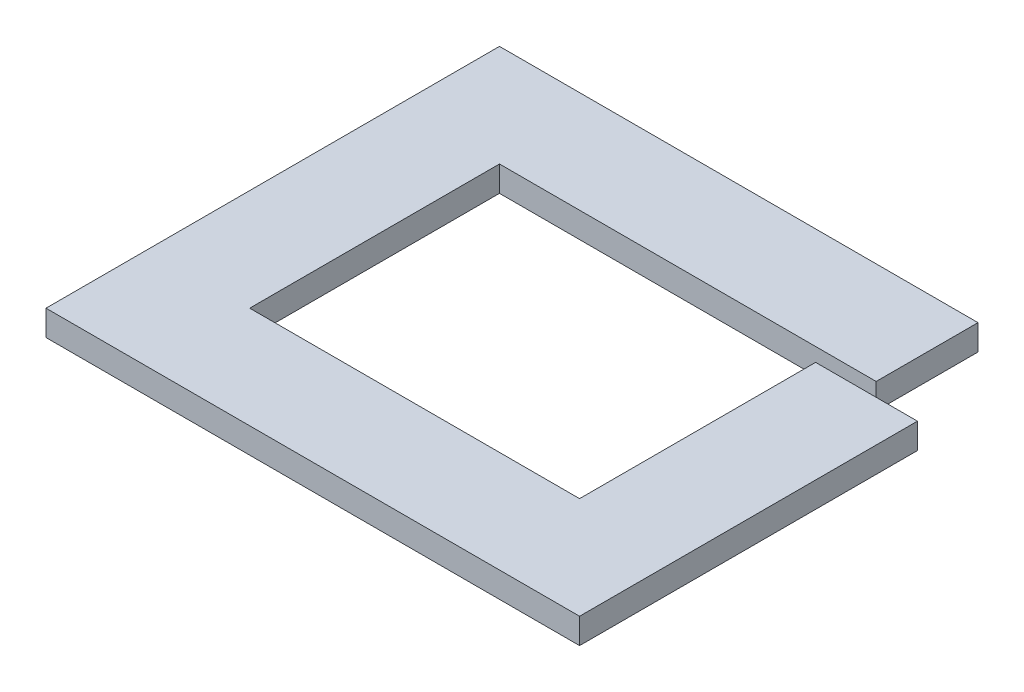
ISO-10303-21;
HEADER;
FILE_DESCRIPTION(('STEP AP214'),'2;1');
FILE_NAME('part.step','',(''),(''),'','','');
FILE_SCHEMA(('AUTOMOTIVE_DESIGN { 1 0 10303 214 1 1 1 1 }'));
ENDSEC;
DATA;
#1=APPLICATION_CONTEXT('core data for automotive mechanical design processes');
#2=APPLICATION_PROTOCOL_DEFINITION('international standard','automotive_design',2000,#1);
#3=PRODUCT_CONTEXT('',#1,'mechanical');
#4=PRODUCT('Part','Part','',(#3));
#5=PRODUCT_RELATED_PRODUCT_CATEGORY('part','',(#4));
#6=PRODUCT_DEFINITION_FORMATION('','',#4);
#7=PRODUCT_DEFINITION_CONTEXT('part definition',#1,'design');
#8=PRODUCT_DEFINITION('design','',#6,#7);
#9=PRODUCT_DEFINITION_SHAPE('','',#8);
#10=(LENGTH_UNIT() NAMED_UNIT(*) SI_UNIT(.MILLI.,.METRE.));
#11=(NAMED_UNIT(*) PLANE_ANGLE_UNIT() SI_UNIT($,.RADIAN.));
#12=(NAMED_UNIT(*) SI_UNIT($,.STERADIAN.) SOLID_ANGLE_UNIT());
#13=UNCERTAINTY_MEASURE_WITH_UNIT(LENGTH_MEASURE(1.E-05),#10,'distance_accuracy_value','');
#14=(GEOMETRIC_REPRESENTATION_CONTEXT(3) GLOBAL_UNCERTAINTY_ASSIGNED_CONTEXT((#13)) GLOBAL_UNIT_ASSIGNED_CONTEXT((#10,
#11,#12)) REPRESENTATION_CONTEXT('',''));
#15=CARTESIAN_POINT('',(0.,0.,0.));
#16=DIRECTION('',(0.,0.,1.));
#17=DIRECTION('',(1.,0.,0.));
#18=AXIS2_PLACEMENT_3D('',#15,#16,#17);
#19=CARTESIAN_POINT('',(-22817.9108837107,5864.45712854682,0.));
#20=DIRECTION('',(1.,0.,0.));
#21=DIRECTION('',(0.,0.,-1.));
#22=AXIS2_PLACEMENT_3D('',#19,#20,#21);
#23=PLANE('',#22);
#24=DIRECTION('',(0.,0.,1.));
#25=VECTOR('',#24,1.);
#26=CARTESIAN_POINT('',(-22817.9108837107,5844.45712854682,0.));
#27=LINE('',#26,#25);
#28=CARTESIAN_POINT('',(-22817.9108837107,5844.45712854682,39924.6673627138));
#29=VERTEX_POINT('',#28);
#30=CARTESIAN_POINT('',(-22817.9108837107,5844.45712854682,40004.6673627138));
#31=VERTEX_POINT('',#30);
#32=EDGE_CURVE('E193',#29,#31,#27,.T.);
#33=ORIENTED_EDGE('',*,*,#32,.F.);
#34=DIRECTION('',(0.,-1.,0.));
#35=VECTOR('',#34,1.);
#36=CARTESIAN_POINT('',(-22817.9108837107,5864.45712854682,39924.6673627138));
#37=LINE('',#36,#35);
#38=CARTESIAN_POINT('',(-22817.9108837107,5864.45712854682,39924.6673627138));
#39=VERTEX_POINT('',#38);
#40=EDGE_CURVE('E222',#39,#29,#37,.T.);
#41=ORIENTED_EDGE('',*,*,#40,.F.);
#42=DIRECTION('',(0.,0.,1.));
#43=VECTOR('',#42,1.);
#44=CARTESIAN_POINT('',(-22817.9108837107,5864.45712854682,0.));
#45=LINE('',#44,#43);
#46=CARTESIAN_POINT('',(-22817.9108837107,5864.45712854682,40004.6673627138));
#47=VERTEX_POINT('',#46);
#48=EDGE_CURVE('E229',#39,#47,#45,.T.);
#49=ORIENTED_EDGE('',*,*,#48,.T.);
#50=DIRECTION('',(0.,-1.,0.));
#51=VECTOR('',#50,1.);
#52=CARTESIAN_POINT('',(-22817.9108837107,5864.45712854682,40004.6673627138));
#53=LINE('',#52,#51);
#54=EDGE_CURVE('E90',#47,#31,#53,.T.);
#55=ORIENTED_EDGE('',*,*,#54,.T.);
#56=EDGE_LOOP('',(#33,#41,#49,#55));
#57=FACE_BOUND('',#56,.T.);
#58=ADVANCED_FACE('F81',(#57),#23,.T.);
#59=CARTESIAN_POINT('',(0.,5844.45712854682,0.));
#60=DIRECTION('',(0.,1.,0.));
#61=DIRECTION('',(0.,0.,1.));
#62=AXIS2_PLACEMENT_3D('',#59,#60,#61);
#63=PLANE('',#62);
#64=DIRECTION('',(1.,0.,0.));
#65=VECTOR('',#64,1.);
#66=CARTESIAN_POINT('',(0.,5844.45712854682,40004.6673627138));
#67=LINE('',#66,#65);
#68=CARTESIAN_POINT('',(-23113.7900934544,5844.45712854682,40004.6673627138));
#69=VERTEX_POINT('',#68);
#70=EDGE_CURVE('E190',#69,#31,#67,.T.);
#71=ORIENTED_EDGE('',*,*,#70,.F.);
#72=DIRECTION('',(0.,0.,1.));
#73=VECTOR('',#72,1.);
#74=CARTESIAN_POINT('',(-23113.7900934544,5844.45712854682,0.));
#75=LINE('',#74,#73);
#76=CARTESIAN_POINT('',(-23113.7900934544,5844.45712854682,40200.8713129914));
#77=VERTEX_POINT('',#76);
#78=EDGE_CURVE('E188',#69,#77,#75,.T.);
#79=ORIENTED_EDGE('',*,*,#78,.T.);
#80=DIRECTION('',(1.,0.,0.));
#81=VECTOR('',#80,1.);
#82=CARTESIAN_POINT('',(0.,5844.45712854682,40200.8713129914));
#83=LINE('',#82,#81);
#84=CARTESIAN_POINT('',(-22854.6699780642,5844.45712854682,40200.8713129914));
#85=VERTEX_POINT('',#84);
#86=EDGE_CURVE('E207',#77,#85,#83,.T.);
#87=ORIENTED_EDGE('',*,*,#86,.T.);
#88=DIRECTION('',(0.,0.,-1.));
#89=VECTOR('',#88,1.);
#90=CARTESIAN_POINT('',(-22854.6699780642,5844.45712854682,0.));
#91=LINE('',#90,#89);
#92=CARTESIAN_POINT('',(-22854.6699780642,5844.45712854682,40015.4673627138));
#93=VERTEX_POINT('',#92);
#94=EDGE_CURVE('E205',#85,#93,#91,.T.);
#95=ORIENTED_EDGE('',*,*,#94,.T.);
#96=DIRECTION('',(-1.,0.,0.));
#97=VECTOR('',#96,1.);
#98=CARTESIAN_POINT('',(-1.50325820692424E-11,5844.45712854682,40015.4673627138));
#99=LINE('',#98,#97);
#100=CARTESIAN_POINT('',(-22774.6699780642,5844.45712854682,40015.4673627138));
#101=VERTEX_POINT('',#100);
#102=EDGE_CURVE('E177',#101,#93,#99,.T.);
#103=ORIENTED_EDGE('',*,*,#102,.F.);
#104=DIRECTION('',(0.,0.,-1.));
#105=VECTOR('',#104,1.);
#106=CARTESIAN_POINT('',(-22774.6699780642,5844.45712854682,0.));
#107=LINE('',#106,#105);
#108=CARTESIAN_POINT('',(-22774.6699780642,5844.45712854682,40280.8713129914));
#109=VERTEX_POINT('',#108);
#110=EDGE_CURVE('E202',#109,#101,#107,.T.);
#111=ORIENTED_EDGE('',*,*,#110,.F.);
#112=DIRECTION('',(1.,0.,0.));
#113=VECTOR('',#112,1.);
#114=CARTESIAN_POINT('',(0.,5844.45712854682,40280.8713129914));
#115=LINE('',#114,#113);
#116=CARTESIAN_POINT('',(-23193.7900934544,5844.45712854682,40280.8713129914));
#117=VERTEX_POINT('',#116);
#118=EDGE_CURVE('E200',#117,#109,#115,.T.);
#119=ORIENTED_EDGE('',*,*,#118,.F.);
#120=DIRECTION('',(0.,0.,1.));
#121=VECTOR('',#120,1.);
#122=CARTESIAN_POINT('',(-23193.7900934544,5844.45712854682,0.));
#123=LINE('',#122,#121);
#124=CARTESIAN_POINT('',(-23193.7900934544,5844.45712854682,39924.6673627138));
#125=VERTEX_POINT('',#124);
#126=EDGE_CURVE('E198',#125,#117,#123,.T.);
#127=ORIENTED_EDGE('',*,*,#126,.F.);
#128=DIRECTION('',(1.,0.,0.));
#129=VECTOR('',#128,1.);
#130=CARTESIAN_POINT('',(0.,5844.45712854682,39924.6673627138));
#131=LINE('',#130,#129);
#132=EDGE_CURVE('E196',#125,#29,#131,.T.);
#133=ORIENTED_EDGE('',*,*,#132,.T.);
#134=ORIENTED_EDGE('',*,*,#32,.T.);
#135=EDGE_LOOP('',(#71,#79,#87,#95,#103,#111,#119,#127,#133,#134));
#136=FACE_BOUND('',#135,.T.);
#137=ADVANCED_FACE('F234',(#136),#63,.F.);
#138=CARTESIAN_POINT('',(0.,5864.45712854682,40004.6673627138));
#139=DIRECTION('',(0.,0.,-1.));
#140=DIRECTION('',(-1.,0.,0.));
#141=AXIS2_PLACEMENT_3D('',#138,#139,#140);
#142=PLANE('',#141);
#143=ORIENTED_EDGE('',*,*,#70,.T.);
#144=ORIENTED_EDGE('',*,*,#54,.F.);
#145=DIRECTION('',(1.,0.,0.));
#146=VECTOR('',#145,1.);
#147=CARTESIAN_POINT('',(0.,5864.45712854682,40004.6673627138));
#148=LINE('',#147,#146);
#149=CARTESIAN_POINT('',(-23113.7900934544,5864.45712854682,40004.6673627138));
#150=VERTEX_POINT('',#149);
#151=EDGE_CURVE('E243',#150,#47,#148,.T.);
#152=ORIENTED_EDGE('',*,*,#151,.F.);
#153=DIRECTION('',(0.,-1.,0.));
#154=VECTOR('',#153,1.);
#155=CARTESIAN_POINT('',(-23113.7900934544,5864.45712854682,40004.6673627138));
#156=LINE('',#155,#154);
#157=EDGE_CURVE('E12',#150,#69,#156,.T.);
#158=ORIENTED_EDGE('',*,*,#157,.T.);
#159=EDGE_LOOP('',(#143,#144,#152,#158));
#160=FACE_BOUND('',#159,.T.);
#161=ADVANCED_FACE('F232',(#160),#142,.F.);
#162=CARTESIAN_POINT('',(0.,5864.45712854682,39924.6673627138));
#163=DIRECTION('',(0.,0.,-1.));
#164=DIRECTION('',(-1.,0.,0.));
#165=AXIS2_PLACEMENT_3D('',#162,#163,#164);
#166=PLANE('',#165);
#167=ORIENTED_EDGE('',*,*,#40,.T.);
#168=ORIENTED_EDGE('',*,*,#132,.F.);
#169=DIRECTION('',(0.,-1.,0.));
#170=VECTOR('',#169,1.);
#171=CARTESIAN_POINT('',(-23193.7900934544,5864.45712854682,39924.6673627138));
#172=LINE('',#171,#170);
#173=CARTESIAN_POINT('',(-23193.7900934544,5864.45712854682,39924.6673627138));
#174=VERTEX_POINT('',#173);
#175=EDGE_CURVE('E220',#174,#125,#172,.T.);
#176=ORIENTED_EDGE('',*,*,#175,.F.);
#177=DIRECTION('',(1.,0.,0.));
#178=VECTOR('',#177,1.);
#179=CARTESIAN_POINT('',(0.,5864.45712854682,39924.6673627138));
#180=LINE('',#179,#178);
#181=EDGE_CURVE('E241',#174,#39,#180,.T.);
#182=ORIENTED_EDGE('',*,*,#181,.T.);
#183=EDGE_LOOP('',(#167,#168,#176,#182));
#184=FACE_BOUND('',#183,.T.);
#185=ADVANCED_FACE('F239',(#184),#166,.T.);
#186=CARTESIAN_POINT('',(0.,5864.45712854682,0.));
#187=DIRECTION('',(0.,1.,0.));
#188=DIRECTION('',(0.,0.,1.));
#189=AXIS2_PLACEMENT_3D('',#186,#187,#188);
#190=PLANE('',#189);
#191=ORIENTED_EDGE('',*,*,#48,.F.);
#192=ORIENTED_EDGE('',*,*,#181,.F.);
#193=DIRECTION('',(0.,0.,1.));
#194=VECTOR('',#193,1.);
#195=CARTESIAN_POINT('',(-23193.7900934544,5864.45712854682,0.));
#196=LINE('',#195,#194);
#197=CARTESIAN_POINT('',(-23193.7900934544,5864.45712854682,40280.8713129914));
#198=VERTEX_POINT('',#197);
#199=EDGE_CURVE('E245',#174,#198,#196,.T.);
#200=ORIENTED_EDGE('',*,*,#199,.T.);
#201=DIRECTION('',(1.,0.,0.));
#202=VECTOR('',#201,1.);
#203=CARTESIAN_POINT('',(0.,5864.45712854682,40280.8713129914));
#204=LINE('',#203,#202);
#205=CARTESIAN_POINT('',(-22774.6699780642,5864.45712854682,40280.8713129914));
#206=VERTEX_POINT('',#205);
#207=EDGE_CURVE('E251',#198,#206,#204,.T.);
#208=ORIENTED_EDGE('',*,*,#207,.T.);
#209=DIRECTION('',(0.,0.,-1.));
#210=VECTOR('',#209,1.);
#211=CARTESIAN_POINT('',(-22774.6699780642,5864.45712854682,0.));
#212=LINE('',#211,#210);
#213=CARTESIAN_POINT('',(-22774.6699780642,5864.45712854682,40015.4673627138));
#214=VERTEX_POINT('',#213);
#215=EDGE_CURVE('E168',#206,#214,#212,.T.);
#216=ORIENTED_EDGE('',*,*,#215,.T.);
#217=DIRECTION('',(-1.,0.,0.));
#218=VECTOR('',#217,1.);
#219=CARTESIAN_POINT('',(-1.50325820692424E-11,5864.45712854682,40015.4673627138));
#220=LINE('',#219,#218);
#221=CARTESIAN_POINT('',(-22854.6699780642,5864.45712854682,40015.4673627138));
#222=VERTEX_POINT('',#221);
#223=EDGE_CURVE('E160',#214,#222,#220,.T.);
#224=ORIENTED_EDGE('',*,*,#223,.T.);
#225=DIRECTION('',(0.,0.,-1.));
#226=VECTOR('',#225,1.);
#227=CARTESIAN_POINT('',(-22854.6699780642,5864.45712854682,0.));
#228=LINE('',#227,#226);
#229=CARTESIAN_POINT('',(-22854.6699780642,5864.45712854682,40200.8713129914));
#230=VERTEX_POINT('',#229);
#231=EDGE_CURVE('E166',#230,#222,#228,.T.);
#232=ORIENTED_EDGE('',*,*,#231,.F.);
#233=DIRECTION('',(1.,0.,0.));
#234=VECTOR('',#233,1.);
#235=CARTESIAN_POINT('',(0.,5864.45712854682,40200.8713129914));
#236=LINE('',#235,#234);
#237=CARTESIAN_POINT('',(-23113.7900934544,5864.45712854682,40200.8713129914));
#238=VERTEX_POINT('',#237);
#239=EDGE_CURVE('E183',#238,#230,#236,.T.);
#240=ORIENTED_EDGE('',*,*,#239,.F.);
#241=DIRECTION('',(0.,0.,1.));
#242=VECTOR('',#241,1.);
#243=CARTESIAN_POINT('',(-23113.7900934544,5864.45712854682,0.));
#244=LINE('',#243,#242);
#245=EDGE_CURVE('E210',#150,#238,#244,.T.);
#246=ORIENTED_EDGE('',*,*,#245,.F.);
#247=ORIENTED_EDGE('',*,*,#151,.T.);
#248=EDGE_LOOP('',(#191,#192,#200,#208,#216,#224,#232,#240,#246,#247));
#249=FACE_BOUND('',#248,.T.);
#250=ADVANCED_FACE('F163',(#249),#190,.T.);
#251=CARTESIAN_POINT('',(-23193.7900934544,5864.45712854682,0.));
#252=DIRECTION('',(1.,0.,0.));
#253=DIRECTION('',(0.,0.,-1.));
#254=AXIS2_PLACEMENT_3D('',#251,#252,#253);
#255=PLANE('',#254);
#256=ORIENTED_EDGE('',*,*,#126,.T.);
#257=DIRECTION('',(0.,-1.,0.));
#258=VECTOR('',#257,1.);
#259=CARTESIAN_POINT('',(-23193.7900934544,5864.45712854682,40280.8713129914));
#260=LINE('',#259,#258);
#261=EDGE_CURVE('E217',#198,#117,#260,.T.);
#262=ORIENTED_EDGE('',*,*,#261,.F.);
#263=ORIENTED_EDGE('',*,*,#199,.F.);
#264=ORIENTED_EDGE('',*,*,#175,.T.);
#265=EDGE_LOOP('',(#256,#262,#263,#264));
#266=FACE_BOUND('',#265,.T.);
#267=ADVANCED_FACE('F275',(#266),#255,.F.);
#268=CARTESIAN_POINT('',(0.,5864.45712854682,40280.8713129914));
#269=DIRECTION('',(0.,0.,-1.));
#270=DIRECTION('',(-1.,0.,0.));
#271=AXIS2_PLACEMENT_3D('',#268,#269,#270);
#272=PLANE('',#271);
#273=ORIENTED_EDGE('',*,*,#118,.T.);
#274=DIRECTION('',(0.,-1.,0.));
#275=VECTOR('',#274,1.);
#276=CARTESIAN_POINT('',(-22774.6699780642,5864.45712854682,40280.8713129914));
#277=LINE('',#276,#275);
#278=EDGE_CURVE('E214',#206,#109,#277,.T.);
#279=ORIENTED_EDGE('',*,*,#278,.F.);
#280=ORIENTED_EDGE('',*,*,#207,.F.);
#281=ORIENTED_EDGE('',*,*,#261,.T.);
#282=EDGE_LOOP('',(#273,#279,#280,#281));
#283=FACE_BOUND('',#282,.T.);
#284=ADVANCED_FACE('F257',(#283),#272,.F.);
#285=CARTESIAN_POINT('',(-22774.6699780642,5864.45712854682,0.));
#286=DIRECTION('',(-1.,0.,0.));
#287=DIRECTION('',(0.,0.,1.));
#288=AXIS2_PLACEMENT_3D('',#285,#286,#287);
#289=PLANE('',#288);
#290=ORIENTED_EDGE('',*,*,#110,.T.);
#291=DIRECTION('',(0.,-1.,0.));
#292=VECTOR('',#291,1.);
#293=CARTESIAN_POINT('',(-22774.6699780642,5864.45712854682,40015.4673627138));
#294=LINE('',#293,#292);
#295=EDGE_CURVE('E180',#214,#101,#294,.T.);
#296=ORIENTED_EDGE('',*,*,#295,.F.);
#297=ORIENTED_EDGE('',*,*,#215,.F.);
#298=ORIENTED_EDGE('',*,*,#278,.T.);
#299=EDGE_LOOP('',(#290,#296,#297,#298));
#300=FACE_BOUND('',#299,.T.);
#301=ADVANCED_FACE('F260',(#300),#289,.F.);
#302=CARTESIAN_POINT('',(-1.50325820692424E-11,5864.45712854682,40015.4673627138));
#303=DIRECTION('',(0.,0.,1.));
#304=DIRECTION('',(1.,0.,0.));
#305=AXIS2_PLACEMENT_3D('',#302,#303,#304);
#306=PLANE('',#305);
#307=ORIENTED_EDGE('',*,*,#102,.T.);
#308=DIRECTION('',(0.,-1.,0.));
#309=VECTOR('',#308,1.);
#310=CARTESIAN_POINT('',(-22854.6699780642,5864.45712854682,40015.4673627138));
#311=LINE('',#310,#309);
#312=EDGE_CURVE('E174',#222,#93,#311,.T.);
#313=ORIENTED_EDGE('',*,*,#312,.F.);
#314=ORIENTED_EDGE('',*,*,#223,.F.);
#315=ORIENTED_EDGE('',*,*,#295,.T.);
#316=EDGE_LOOP('',(#307,#313,#314,#315));
#317=FACE_BOUND('',#316,.T.);
#318=ADVANCED_FACE('F175',(#317),#306,.F.);
#319=CARTESIAN_POINT('',(-22854.6699780642,5864.45712854682,0.));
#320=DIRECTION('',(-1.,0.,0.));
#321=DIRECTION('',(0.,0.,1.));
#322=AXIS2_PLACEMENT_3D('',#319,#320,#321);
#323=PLANE('',#322);
#324=ORIENTED_EDGE('',*,*,#94,.F.);
#325=DIRECTION('',(0.,-1.,0.));
#326=VECTOR('',#325,1.);
#327=CARTESIAN_POINT('',(-22854.6699780642,5864.45712854682,40200.8713129914));
#328=LINE('',#327,#326);
#329=EDGE_CURVE('E129',#230,#85,#328,.T.);
#330=ORIENTED_EDGE('',*,*,#329,.F.);
#331=ORIENTED_EDGE('',*,*,#231,.T.);
#332=ORIENTED_EDGE('',*,*,#312,.T.);
#333=EDGE_LOOP('',(#324,#330,#331,#332));
#334=FACE_BOUND('',#333,.T.);
#335=ADVANCED_FACE('F182',(#334),#323,.T.);
#336=CARTESIAN_POINT('',(0.,5864.45712854682,40200.8713129914));
#337=DIRECTION('',(0.,0.,-1.));
#338=DIRECTION('',(-1.,0.,0.));
#339=AXIS2_PLACEMENT_3D('',#336,#337,#338);
#340=PLANE('',#339);
#341=ORIENTED_EDGE('',*,*,#86,.F.);
#342=DIRECTION('',(0.,-1.,0.));
#343=VECTOR('',#342,1.);
#344=CARTESIAN_POINT('',(-23113.7900934544,5864.45712854682,40200.8713129914));
#345=LINE('',#344,#343);
#346=EDGE_CURVE('E98',#238,#77,#345,.T.);
#347=ORIENTED_EDGE('',*,*,#346,.F.);
#348=ORIENTED_EDGE('',*,*,#239,.T.);
#349=ORIENTED_EDGE('',*,*,#329,.T.);
#350=EDGE_LOOP('',(#341,#347,#348,#349));
#351=FACE_BOUND('',#350,.T.);
#352=ADVANCED_FACE('F261',(#351),#340,.T.);
#353=CARTESIAN_POINT('',(-23113.7900934544,5864.45712854682,0.));
#354=DIRECTION('',(1.,0.,0.));
#355=DIRECTION('',(0.,0.,-1.));
#356=AXIS2_PLACEMENT_3D('',#353,#354,#355);
#357=PLANE('',#356);
#358=ORIENTED_EDGE('',*,*,#78,.F.);
#359=ORIENTED_EDGE('',*,*,#157,.F.);
#360=ORIENTED_EDGE('',*,*,#245,.T.);
#361=ORIENTED_EDGE('',*,*,#346,.T.);
#362=EDGE_LOOP('',(#358,#359,#360,#361));
#363=FACE_BOUND('',#362,.T.);
#364=ADVANCED_FACE('F83',(#363),#357,.T.);
#365=CLOSED_SHELL('',(#58,#137,#161,#185,#250,#267,#284,#301,#318,#335,#352,#364));
#366=MANIFOLD_SOLID_BREP('B2',#365);
#367=ADVANCED_BREP_SHAPE_REPRESENTATION('',(#18,#366),#14);
#368=SHAPE_DEFINITION_REPRESENTATION(#9,#367);
ENDSEC;
END-ISO-10303-21;
